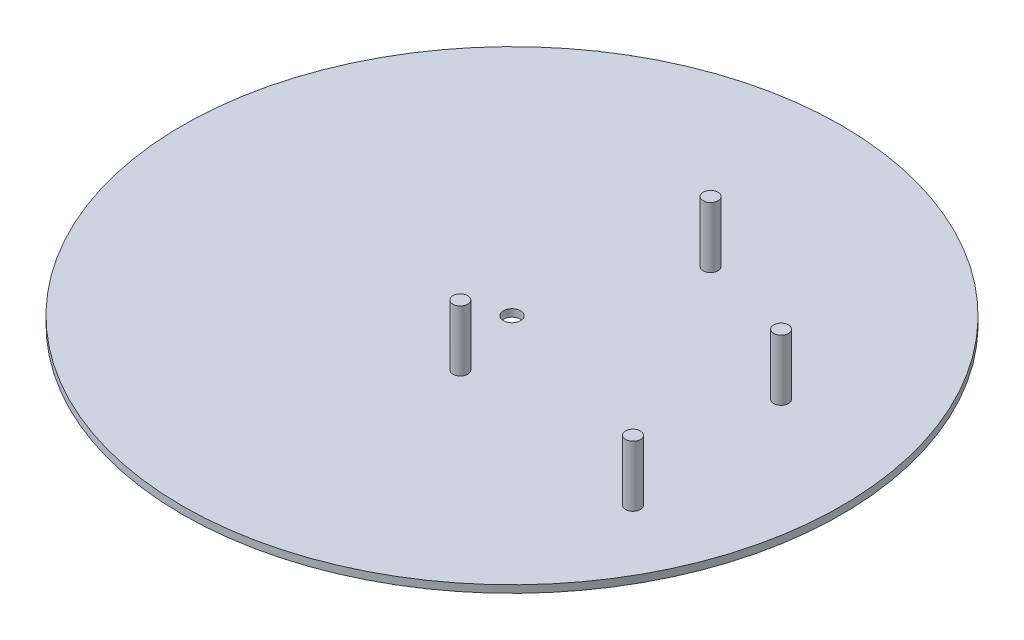
ISO-10303-21;
HEADER;
FILE_DESCRIPTION(('STEP AP214'),'2;1');
FILE_NAME('part.step','',(''),(''),'','','');
FILE_SCHEMA(('AUTOMOTIVE_DESIGN { 1 0 10303 214 1 1 1 1 }'));
ENDSEC;
DATA;
#1=APPLICATION_CONTEXT('core data for automotive mechanical design processes');
#2=APPLICATION_PROTOCOL_DEFINITION('international standard','automotive_design',2000,#1);
#3=PRODUCT_CONTEXT('',#1,'mechanical');
#4=PRODUCT('Part','Part','',(#3));
#5=PRODUCT_RELATED_PRODUCT_CATEGORY('part','',(#4));
#6=PRODUCT_DEFINITION_FORMATION('','',#4);
#7=PRODUCT_DEFINITION_CONTEXT('part definition',#1,'design');
#8=PRODUCT_DEFINITION('design','',#6,#7);
#9=PRODUCT_DEFINITION_SHAPE('','',#8);
#10=(LENGTH_UNIT() NAMED_UNIT(*) SI_UNIT(.MILLI.,.METRE.));
#11=(NAMED_UNIT(*) PLANE_ANGLE_UNIT() SI_UNIT($,.RADIAN.));
#12=(NAMED_UNIT(*) SI_UNIT($,.STERADIAN.) SOLID_ANGLE_UNIT());
#13=UNCERTAINTY_MEASURE_WITH_UNIT(LENGTH_MEASURE(1.E-05),#10,'distance_accuracy_value','');
#14=(GEOMETRIC_REPRESENTATION_CONTEXT(3) GLOBAL_UNCERTAINTY_ASSIGNED_CONTEXT((#13)) GLOBAL_UNIT_ASSIGNED_CONTEXT((#10,
#11,#12)) REPRESENTATION_CONTEXT('',''));
#15=CARTESIAN_POINT('',(0.,0.,0.));
#16=DIRECTION('',(0.,0.,1.));
#17=DIRECTION('',(1.,0.,0.));
#18=AXIS2_PLACEMENT_3D('',#15,#16,#17);
#19=CARTESIAN_POINT('',(0.,2.5,0.));
#20=DIRECTION('',(0.,1.,0.));
#21=DIRECTION('',(0.,0.,1.));
#22=AXIS2_PLACEMENT_3D('',#19,#20,#21);
#23=PLANE('',#22);
#24=CARTESIAN_POINT('',(69.8524590163935,2.5,-21.));
#25=DIRECTION('',(0.,1.,0.));
#26=DIRECTION('',(0.,0.,1.));
#27=AXIS2_PLACEMENT_3D('',#24,#25,#26);
#28=CIRCLE('',#27,2.5);
#29=CARTESIAN_POINT('',(69.8524590163935,2.5,-18.5));
#30=VERTEX_POINT('',#29);
#31=EDGE_CURVE('E101',#30,#30,#28,.T.);
#32=ORIENTED_EDGE('',*,*,#31,.F.);
#33=EDGE_LOOP('',(#32));
#34=FACE_BOUND('',#33,.T.);
#35=CARTESIAN_POINT('',(75.8524590163935,2.5,35.));
#36=DIRECTION('',(0.,1.,0.));
#37=DIRECTION('',(0.,0.,1.));
#38=AXIS2_PLACEMENT_3D('',#35,#36,#37);
#39=CIRCLE('',#38,2.5);
#40=CARTESIAN_POINT('',(75.8524590163935,2.5,37.5));
#41=VERTEX_POINT('',#40);
#42=EDGE_CURVE('E90',#41,#41,#39,.T.);
#43=ORIENTED_EDGE('',*,*,#42,.F.);
#44=EDGE_LOOP('',(#43));
#45=FACE_BOUND('',#44,.T.);
#46=CARTESIAN_POINT('',(0.,2.5,0.));
#47=DIRECTION('',(0.,1.,0.));
#48=DIRECTION('',(0.,0.,1.));
#49=AXIS2_PLACEMENT_3D('',#46,#47,#48);
#50=CIRCLE('',#49,111.264222233471);
#51=CARTESIAN_POINT('',(0.,2.5,111.264222233471));
#52=VERTEX_POINT('',#51);
#53=EDGE_CURVE('E11',#52,#52,#50,.T.);
#54=ORIENTED_EDGE('',*,*,#53,.T.);
#55=EDGE_LOOP('',(#54));
#56=FACE_BOUND('',#55,.T.);
#57=CARTESIAN_POINT('',(0.,2.5,0.));
#58=DIRECTION('',(0.,1.,0.));
#59=DIRECTION('',(0.,0.,1.));
#60=AXIS2_PLACEMENT_3D('',#57,#58,#59);
#61=CIRCLE('',#60,2.92);
#62=CARTESIAN_POINT('',(0.,2.5,2.92));
#63=VERTEX_POINT('',#62);
#64=EDGE_CURVE('E84',#63,#63,#61,.T.);
#65=ORIENTED_EDGE('',*,*,#64,.F.);
#66=EDGE_LOOP('',(#65));
#67=FACE_BOUND('',#66,.T.);
#68=CARTESIAN_POINT('',(7.15245901639347,2.5,24.6));
#69=DIRECTION('',(0.,1.,0.));
#70=DIRECTION('',(0.,0.,1.));
#71=AXIS2_PLACEMENT_3D('',#68,#69,#70);
#72=CIRCLE('',#71,2.5);
#73=CARTESIAN_POINT('',(7.15245901639347,2.5,27.1));
#74=VERTEX_POINT('',#73);
#75=EDGE_CURVE('E97',#74,#74,#72,.T.);
#76=ORIENTED_EDGE('',*,*,#75,.F.);
#77=EDGE_LOOP('',(#76));
#78=FACE_BOUND('',#77,.T.);
#79=CARTESIAN_POINT('',(19.1524590163935,2.5,-47.9));
#80=DIRECTION('',(0.,1.,0.));
#81=DIRECTION('',(0.,0.,1.));
#82=AXIS2_PLACEMENT_3D('',#79,#80,#81);
#83=CIRCLE('',#82,2.5);
#84=CARTESIAN_POINT('',(19.1524590163935,2.5,-45.4));
#85=VERTEX_POINT('',#84);
#86=EDGE_CURVE('E105',#85,#85,#83,.T.);
#87=ORIENTED_EDGE('',*,*,#86,.F.);
#88=EDGE_LOOP('',(#87));
#89=FACE_BOUND('',#88,.T.);
#90=ADVANCED_FACE('F71',(#34,#45,#56,#67,#78,#89),#23,.T.);
#91=CARTESIAN_POINT('',(0.,0.,0.));
#92=DIRECTION('',(0.,1.,0.));
#93=DIRECTION('',(0.,0.,1.));
#94=AXIS2_PLACEMENT_3D('',#91,#92,#93);
#95=PLANE('',#94);
#96=CARTESIAN_POINT('',(0.,0.,0.));
#97=DIRECTION('',(0.,1.,0.));
#98=DIRECTION('',(0.,0.,1.));
#99=AXIS2_PLACEMENT_3D('',#96,#97,#98);
#100=CIRCLE('',#99,111.264222233471);
#101=CARTESIAN_POINT('',(0.,0.,111.264222233471));
#102=VERTEX_POINT('',#101);
#103=EDGE_CURVE('E75',#102,#102,#100,.T.);
#104=ORIENTED_EDGE('',*,*,#103,.F.);
#105=EDGE_LOOP('',(#104));
#106=FACE_BOUND('',#105,.T.);
#107=CARTESIAN_POINT('',(0.,0.,0.));
#108=DIRECTION('',(0.,1.,0.));
#109=DIRECTION('',(0.,0.,1.));
#110=AXIS2_PLACEMENT_3D('',#107,#108,#109);
#111=CIRCLE('',#110,2.92);
#112=CARTESIAN_POINT('',(0.,0.,2.92));
#113=VERTEX_POINT('',#112);
#114=EDGE_CURVE('E86',#113,#113,#111,.T.);
#115=ORIENTED_EDGE('',*,*,#114,.T.);
#116=EDGE_LOOP('',(#115));
#117=FACE_BOUND('',#116,.T.);
#118=ADVANCED_FACE('F138',(#106,#117),#95,.F.);
#119=CARTESIAN_POINT('',(0.,2.5,0.));
#120=DIRECTION('',(0.,-1.,0.));
#121=DIRECTION('',(0.,0.,-1.));
#122=AXIS2_PLACEMENT_3D('',#119,#120,#121);
#123=CYLINDRICAL_SURFACE('',#122,111.264222233471);
#124=ORIENTED_EDGE('',*,*,#53,.F.);
#125=EDGE_LOOP('',(#124));
#126=FACE_BOUND('',#125,.T.);
#127=ORIENTED_EDGE('',*,*,#103,.T.);
#128=EDGE_LOOP('',(#127));
#129=FACE_BOUND('',#128,.T.);
#130=ADVANCED_FACE('F73',(#126,#129),#123,.T.);
#131=CARTESIAN_POINT('',(0.,2.5,0.));
#132=DIRECTION('',(0.,-1.,0.));
#133=DIRECTION('',(0.,0.,-1.));
#134=AXIS2_PLACEMENT_3D('',#131,#132,#133);
#135=CYLINDRICAL_SURFACE('',#134,2.92);
#136=ORIENTED_EDGE('',*,*,#64,.T.);
#137=EDGE_LOOP('',(#136));
#138=FACE_BOUND('',#137,.T.);
#139=ORIENTED_EDGE('',*,*,#114,.F.);
#140=EDGE_LOOP('',(#139));
#141=FACE_BOUND('',#140,.T.);
#142=ADVANCED_FACE('F148',(#138,#141),#135,.F.);
#143=CARTESIAN_POINT('',(19.1524590163935,23.,-47.9));
#144=DIRECTION('',(0.,-1.,0.));
#145=DIRECTION('',(0.,0.,-1.));
#146=AXIS2_PLACEMENT_3D('',#143,#144,#145);
#147=CYLINDRICAL_SURFACE('',#146,2.5);
#148=ORIENTED_EDGE('',*,*,#86,.T.);
#149=EDGE_LOOP('',(#148));
#150=FACE_BOUND('',#149,.T.);
#151=CARTESIAN_POINT('',(19.1524590163935,23.,-47.9));
#152=DIRECTION('',(0.,-1.,0.));
#153=DIRECTION('',(0.,0.,-1.));
#154=AXIS2_PLACEMENT_3D('',#151,#152,#153);
#155=CIRCLE('',#154,2.5);
#156=CARTESIAN_POINT('',(19.1524590163935,23.,-50.4));
#157=VERTEX_POINT('',#156);
#158=EDGE_CURVE('E109',#157,#157,#155,.T.);
#159=ORIENTED_EDGE('',*,*,#158,.T.);
#160=EDGE_LOOP('',(#159));
#161=FACE_BOUND('',#160,.T.);
#162=ADVANCED_FACE('F151',(#150,#161),#147,.T.);
#163=CARTESIAN_POINT('',(19.1524590163935,23.,-47.9));
#164=DIRECTION('',(0.,-1.,0.));
#165=DIRECTION('',(0.,0.,-1.));
#166=AXIS2_PLACEMENT_3D('',#163,#164,#165);
#167=PLANE('',#166);
#168=ORIENTED_EDGE('',*,*,#158,.F.);
#169=EDGE_LOOP('',(#168));
#170=FACE_BOUND('',#169,.T.);
#171=ADVANCED_FACE('F155',(#170),#167,.F.);
#172=CARTESIAN_POINT('',(69.8524590163935,23.,-21.));
#173=DIRECTION('',(0.,-1.,0.));
#174=DIRECTION('',(0.,0.,-1.));
#175=AXIS2_PLACEMENT_3D('',#172,#173,#174);
#176=CYLINDRICAL_SURFACE('',#175,2.49999999999999);
#177=ORIENTED_EDGE('',*,*,#31,.T.);
#178=EDGE_LOOP('',(#177));
#179=FACE_BOUND('',#178,.T.);
#180=CARTESIAN_POINT('',(69.8524590163935,23.,-21.));
#181=DIRECTION('',(0.,-1.,0.));
#182=DIRECTION('',(0.,0.,-1.));
#183=AXIS2_PLACEMENT_3D('',#180,#181,#182);
#184=CIRCLE('',#183,2.49999999999999);
#185=CARTESIAN_POINT('',(69.8524590163935,23.,-23.5));
#186=VERTEX_POINT('',#185);
#187=EDGE_CURVE('E113',#186,#186,#184,.T.);
#188=ORIENTED_EDGE('',*,*,#187,.T.);
#189=EDGE_LOOP('',(#188));
#190=FACE_BOUND('',#189,.T.);
#191=ADVANCED_FACE('F159',(#179,#190),#176,.T.);
#192=CARTESIAN_POINT('',(69.8524590163935,23.,-21.));
#193=DIRECTION('',(0.,-1.,0.));
#194=DIRECTION('',(0.,0.,-1.));
#195=AXIS2_PLACEMENT_3D('',#192,#193,#194);
#196=PLANE('',#195);
#197=ORIENTED_EDGE('',*,*,#187,.F.);
#198=EDGE_LOOP('',(#197));
#199=FACE_BOUND('',#198,.T.);
#200=ADVANCED_FACE('F163',(#199),#196,.F.);
#201=CARTESIAN_POINT('',(75.8524590163935,23.,35.));
#202=DIRECTION('',(0.,-1.,0.));
#203=DIRECTION('',(0.,0.,-1.));
#204=AXIS2_PLACEMENT_3D('',#201,#202,#203);
#205=CYLINDRICAL_SURFACE('',#204,2.50000000000001);
#206=ORIENTED_EDGE('',*,*,#42,.T.);
#207=EDGE_LOOP('',(#206));
#208=FACE_BOUND('',#207,.T.);
#209=CARTESIAN_POINT('',(75.8524590163935,23.,35.));
#210=DIRECTION('',(0.,-1.,0.));
#211=DIRECTION('',(0.,0.,-1.));
#212=AXIS2_PLACEMENT_3D('',#209,#210,#211);
#213=CIRCLE('',#212,2.50000000000001);
#214=CARTESIAN_POINT('',(75.8524590163935,23.,32.5));
#215=VERTEX_POINT('',#214);
#216=EDGE_CURVE('E117',#215,#215,#213,.T.);
#217=ORIENTED_EDGE('',*,*,#216,.T.);
#218=EDGE_LOOP('',(#217));
#219=FACE_BOUND('',#218,.T.);
#220=ADVANCED_FACE('F167',(#208,#219),#205,.T.);
#221=CARTESIAN_POINT('',(75.8524590163935,23.,35.));
#222=DIRECTION('',(0.,-1.,0.));
#223=DIRECTION('',(0.,0.,-1.));
#224=AXIS2_PLACEMENT_3D('',#221,#222,#223);
#225=PLANE('',#224);
#226=ORIENTED_EDGE('',*,*,#216,.F.);
#227=EDGE_LOOP('',(#226));
#228=FACE_BOUND('',#227,.T.);
#229=ADVANCED_FACE('F134',(#228),#225,.F.);
#230=CARTESIAN_POINT('',(7.15245901639347,23.,24.6));
#231=DIRECTION('',(0.,-1.,0.));
#232=DIRECTION('',(0.,0.,-1.));
#233=AXIS2_PLACEMENT_3D('',#230,#231,#232);
#234=CYLINDRICAL_SURFACE('',#233,2.5);
#235=ORIENTED_EDGE('',*,*,#75,.T.);
#236=EDGE_LOOP('',(#235));
#237=FACE_BOUND('',#236,.T.);
#238=CARTESIAN_POINT('',(7.15245901639347,23.,24.6));
#239=DIRECTION('',(0.,-1.,0.));
#240=DIRECTION('',(0.,0.,-1.));
#241=AXIS2_PLACEMENT_3D('',#238,#239,#240);
#242=CIRCLE('',#241,2.5);
#243=CARTESIAN_POINT('',(7.15245901639347,23.,22.1));
#244=VERTEX_POINT('',#243);
#245=EDGE_CURVE('E121',#244,#244,#242,.T.);
#246=ORIENTED_EDGE('',*,*,#245,.T.);
#247=EDGE_LOOP('',(#246));
#248=FACE_BOUND('',#247,.T.);
#249=ADVANCED_FACE('F126',(#237,#248),#234,.T.);
#250=CARTESIAN_POINT('',(7.15245901639347,23.,24.6));
#251=DIRECTION('',(0.,-1.,0.));
#252=DIRECTION('',(0.,0.,-1.));
#253=AXIS2_PLACEMENT_3D('',#250,#251,#252);
#254=PLANE('',#253);
#255=ORIENTED_EDGE('',*,*,#245,.F.);
#256=EDGE_LOOP('',(#255));
#257=FACE_BOUND('',#256,.T.);
#258=ADVANCED_FACE('F128',(#257),#254,.F.);
#259=CLOSED_SHELL('',(#90,#118,#130,#142,#162,#171,#191,#200,#220,#229,#249,#258));
#260=MANIFOLD_SOLID_BREP('B2',#259);
#261=ADVANCED_BREP_SHAPE_REPRESENTATION('',(#18,#260),#14);
#262=SHAPE_DEFINITION_REPRESENTATION(#9,#261);
ENDSEC;
END-ISO-10303-21;
